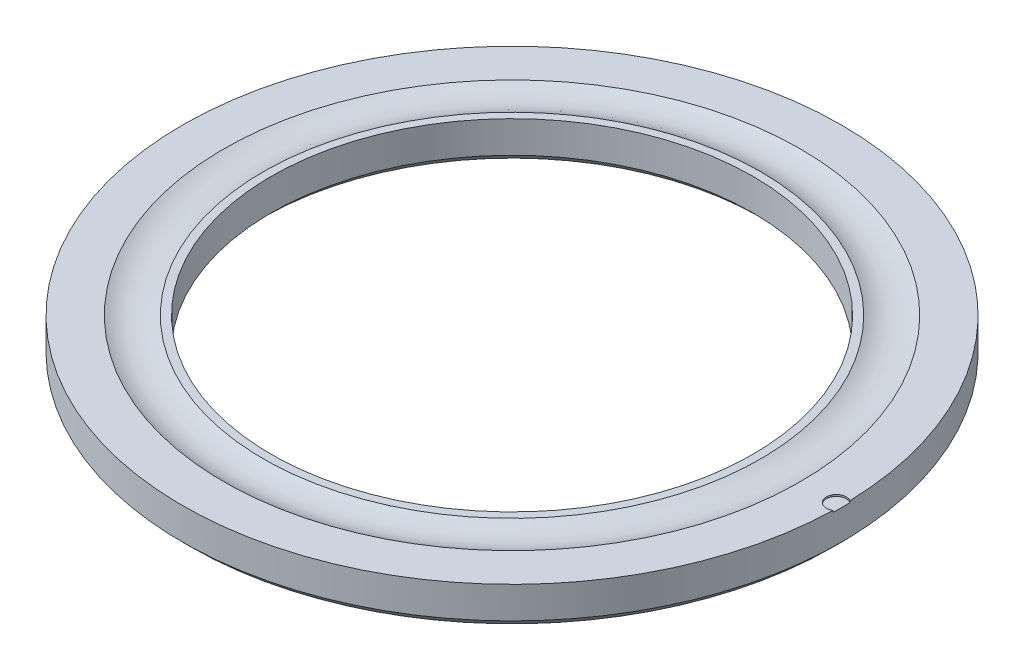
ISO-10303-21;
HEADER;
FILE_DESCRIPTION(('STEP AP214'),'2;1');
FILE_NAME('part.step','',(''),(''),'','','');
FILE_SCHEMA(('AUTOMOTIVE_DESIGN { 1 0 10303 214 1 1 1 1 }'));
ENDSEC;
DATA;
#1=APPLICATION_CONTEXT('core data for automotive mechanical design processes');
#2=APPLICATION_PROTOCOL_DEFINITION('international standard','automotive_design',2000,#1);
#3=PRODUCT_CONTEXT('',#1,'mechanical');
#4=PRODUCT('Part','Part','',(#3));
#5=PRODUCT_RELATED_PRODUCT_CATEGORY('part','',(#4));
#6=PRODUCT_DEFINITION_FORMATION('','',#4);
#7=PRODUCT_DEFINITION_CONTEXT('part definition',#1,'design');
#8=PRODUCT_DEFINITION('design','',#6,#7);
#9=PRODUCT_DEFINITION_SHAPE('','',#8);
#10=(LENGTH_UNIT() NAMED_UNIT(*) SI_UNIT(.MILLI.,.METRE.));
#11=(NAMED_UNIT(*) PLANE_ANGLE_UNIT() SI_UNIT($,.RADIAN.));
#12=(NAMED_UNIT(*) SI_UNIT($,.STERADIAN.) SOLID_ANGLE_UNIT());
#13=UNCERTAINTY_MEASURE_WITH_UNIT(LENGTH_MEASURE(1.E-05),#10,'distance_accuracy_value','');
#14=(GEOMETRIC_REPRESENTATION_CONTEXT(3) GLOBAL_UNCERTAINTY_ASSIGNED_CONTEXT((#13)) GLOBAL_UNIT_ASSIGNED_CONTEXT((#10,
#11,#12)) REPRESENTATION_CONTEXT('',''));
#15=CARTESIAN_POINT('',(0.,0.,0.));
#16=DIRECTION('',(0.,0.,1.));
#17=DIRECTION('',(1.,0.,0.));
#18=AXIS2_PLACEMENT_3D('',#15,#16,#17);
#19=CARTESIAN_POINT('',(0.,0.,0.));
#20=DIRECTION('',(0.,-1.,0.));
#21=DIRECTION('',(0.,0.,-1.));
#22=AXIS2_PLACEMENT_3D('',#19,#20,#21);
#23=CYLINDRICAL_SURFACE('',#22,28.5);
#24=CARTESIAN_POINT('',(0.,0.999999999999977,0.));
#25=DIRECTION('',(0.,-1.,0.));
#26=DIRECTION('',(0.,0.,-1.));
#27=AXIS2_PLACEMENT_3D('',#24,#25,#26);
#28=CIRCLE('',#27,28.5);
#29=CARTESIAN_POINT('',(0.,0.999999999999977,-28.5));
#30=VERTEX_POINT('',#29);
#31=EDGE_CURVE('E87',#30,#30,#28,.T.);
#32=ORIENTED_EDGE('',*,*,#31,.T.);
#33=EDGE_LOOP('',(#32));
#34=FACE_BOUND('',#33,.T.);
#35=CARTESIAN_POINT('',(0.,4.75,0.));
#36=DIRECTION('',(0.,-1.,0.));
#37=DIRECTION('',(0.,0.,-1.));
#38=AXIS2_PLACEMENT_3D('',#35,#36,#37);
#39=CIRCLE('',#38,28.5);
#40=CARTESIAN_POINT('',(0.,4.75,-28.5));
#41=VERTEX_POINT('',#40);
#42=EDGE_CURVE('E78',#41,#41,#39,.T.);
#43=ORIENTED_EDGE('',*,*,#42,.F.);
#44=EDGE_LOOP('',(#43));
#45=FACE_BOUND('',#44,.T.);
#46=ADVANCED_FACE('F43',(#34,#45),#23,.F.);
#47=CARTESIAN_POINT('',(28.5,0.,0.));
#48=DIRECTION('',(0.,-1.,0.));
#49=DIRECTION('',(0.,0.,-1.));
#50=AXIS2_PLACEMENT_3D('',#47,#48,#49);
#51=PLANE('',#50);
#52=CARTESIAN_POINT('',(0.,0.,0.));
#53=DIRECTION('',(0.,-1.,0.));
#54=DIRECTION('',(0.,0.,-1.));
#55=AXIS2_PLACEMENT_3D('',#52,#53,#54);
#56=CIRCLE('',#55,29.5);
#57=CARTESIAN_POINT('',(0.,0.,-29.5));
#58=VERTEX_POINT('',#57);
#59=EDGE_CURVE('E53',#58,#58,#56,.F.);
#60=ORIENTED_EDGE('',*,*,#59,.T.);
#61=EDGE_LOOP('',(#60));
#62=FACE_BOUND('',#61,.T.);
#63=CARTESIAN_POINT('',(0.,0.,0.));
#64=DIRECTION('',(0.,-1.,0.));
#65=DIRECTION('',(0.,0.,-1.));
#66=AXIS2_PLACEMENT_3D('',#63,#64,#65);
#67=CIRCLE('',#66,38.);
#68=CARTESIAN_POINT('',(0.,0.,-38.));
#69=VERTEX_POINT('',#68);
#70=EDGE_CURVE('E94',#69,#69,#67,.T.);
#71=ORIENTED_EDGE('',*,*,#70,.T.);
#72=EDGE_LOOP('',(#71));
#73=FACE_BOUND('',#72,.T.);
#74=ADVANCED_FACE('F105',(#62,#73),#51,.T.);
#75=CARTESIAN_POINT('',(0.,0.,0.));
#76=DIRECTION('',(0.,-1.,0.));
#77=DIRECTION('',(0.,0.,-1.));
#78=AXIS2_PLACEMENT_3D('',#75,#76,#77);
#79=CYLINDRICAL_SURFACE('',#78,39.);
#80=CARTESIAN_POINT('',(0.,0.999999999999994,0.));
#81=DIRECTION('',(0.,-1.,0.));
#82=DIRECTION('',(0.,0.,-1.));
#83=AXIS2_PLACEMENT_3D('',#80,#81,#82);
#84=CIRCLE('',#83,39.);
#85=CARTESIAN_POINT('',(0.,0.999999999999994,-39.));
#86=VERTEX_POINT('',#85);
#87=EDGE_CURVE('E11',#86,#86,#84,.F.);
#88=ORIENTED_EDGE('',*,*,#87,.T.);
#89=EDGE_LOOP('',(#88));
#90=FACE_BOUND('',#89,.T.);
#91=DIRECTION('',(0.,1.,0.));
#92=VECTOR('',#91,1.);
#93=CARTESIAN_POINT('',(38.9870026618739,4.65,1.00678867844529));
#94=LINE('',#93,#92);
#95=CARTESIAN_POINT('',(38.9870026618739,4.75,1.00678867844529));
#96=VERTEX_POINT('',#95);
#97=CARTESIAN_POINT('',(38.9870026618738,4.55,1.00678867844535));
#98=VERTEX_POINT('',#97);
#99=EDGE_CURVE('E70',#96,#98,#94,.F.);
#100=ORIENTED_EDGE('',*,*,#99,.F.);
#101=CARTESIAN_POINT('',(0.,4.75,0.));
#102=DIRECTION('',(0.,-1.,0.));
#103=DIRECTION('',(0.,0.,-1.));
#104=AXIS2_PLACEMENT_3D('',#101,#102,#103);
#105=CIRCLE('',#104,39.);
#106=CARTESIAN_POINT('',(38.9870026618738,4.75,-1.00678867844511));
#107=VERTEX_POINT('',#106);
#108=EDGE_CURVE('E97',#96,#107,#105,.T.);
#109=ORIENTED_EDGE('',*,*,#108,.T.);
#110=DIRECTION('',(0.,1.,0.));
#111=VECTOR('',#110,1.);
#112=CARTESIAN_POINT('',(38.9870026618739,4.65,-1.00678867844529));
#113=LINE('',#112,#111);
#114=CARTESIAN_POINT('',(38.9870026618738,4.55,-1.00678867844535));
#115=VERTEX_POINT('',#114);
#116=EDGE_CURVE('E60',#115,#107,#113,.T.);
#117=ORIENTED_EDGE('',*,*,#116,.F.);
#118=CARTESIAN_POINT('',(0.,4.55,0.));
#119=DIRECTION('',(0.,1.,0.));
#120=DIRECTION('',(0.,0.,1.));
#121=AXIS2_PLACEMENT_3D('',#118,#119,#120);
#122=CIRCLE('',#121,39.);
#123=EDGE_CURVE('E82',#115,#98,#122,.F.);
#124=ORIENTED_EDGE('',*,*,#123,.T.);
#125=EDGE_LOOP('',(#100,#109,#117,#124));
#126=FACE_BOUND('',#125,.T.);
#127=ADVANCED_FACE('F85',(#90,#126),#79,.T.);
#128=CARTESIAN_POINT('',(39.,4.75,0.));
#129=DIRECTION('',(0.,1.,0.));
#130=DIRECTION('',(0.,0.,1.));
#131=AXIS2_PLACEMENT_3D('',#128,#129,#130);
#132=PLANE('',#131);
#133=CARTESIAN_POINT('',(38.3817578484743,4.75,0.));
#134=DIRECTION('',(0.,1.,0.));
#135=DIRECTION('',(0.,0.,1.));
#136=AXIS2_PLACEMENT_3D('',#133,#134,#135);
#137=CIRCLE('',#136,1.17471048654243);
#138=EDGE_CURVE('E64',#107,#96,#137,.T.);
#139=ORIENTED_EDGE('',*,*,#138,.F.);
#140=ORIENTED_EDGE('',*,*,#108,.F.);
#141=EDGE_LOOP('',(#139,#140));
#142=FACE_BOUND('',#141,.T.);
#143=CARTESIAN_POINT('',(0.,4.75,0.));
#144=DIRECTION('',(0.,-1.,0.));
#145=DIRECTION('',(0.,0.,-1.));
#146=AXIS2_PLACEMENT_3D('',#143,#144,#145);
#147=CIRCLE('',#146,34.1178115349775);
#148=CARTESIAN_POINT('',(0.,4.75,-34.1178115349775));
#149=VERTEX_POINT('',#148);
#150=EDGE_CURVE('E122',#149,#149,#147,.T.);
#151=ORIENTED_EDGE('',*,*,#150,.T.);
#152=EDGE_LOOP('',(#151));
#153=FACE_BOUND('',#152,.T.);
#154=ADVANCED_FACE('F132',(#142,#153),#132,.T.);
#155=CARTESIAN_POINT('',(0.,9.17350243368668,0.));
#156=DIRECTION('',(0.,-1.,0.));
#157=DIRECTION('',(0.,0.,-1.));
#158=AXIS2_PLACEMENT_3D('',#155,#156,#157);
#159=TOROIDAL_SURFACE('',#158,31.7747790134954,5.0057142524873);
#160=CARTESIAN_POINT('',(0.,4.75,0.));
#161=DIRECTION('',(0.,-1.,0.));
#162=DIRECTION('',(0.,0.,-1.));
#163=AXIS2_PLACEMENT_3D('',#160,#161,#162);
#164=CIRCLE('',#163,29.4317464920134);
#165=CARTESIAN_POINT('',(0.,4.75,-29.4317464920134));
#166=VERTEX_POINT('',#165);
#167=EDGE_CURVE('E119',#166,#166,#164,.T.);
#168=ORIENTED_EDGE('',*,*,#167,.T.);
#169=EDGE_LOOP('',(#168));
#170=FACE_BOUND('',#169,.T.);
#171=ORIENTED_EDGE('',*,*,#150,.F.);
#172=EDGE_LOOP('',(#171));
#173=FACE_BOUND('',#172,.T.);
#174=ADVANCED_FACE('F134',(#170,#173),#159,.F.);
#175=CARTESIAN_POINT('',(29.4317464920134,4.75,0.));
#176=DIRECTION('',(0.,1.,0.));
#177=DIRECTION('',(0.,0.,1.));
#178=AXIS2_PLACEMENT_3D('',#175,#176,#177);
#179=PLANE('',#178);
#180=ORIENTED_EDGE('',*,*,#42,.T.);
#181=EDGE_LOOP('',(#180));
#182=FACE_BOUND('',#181,.T.);
#183=ORIENTED_EDGE('',*,*,#167,.F.);
#184=EDGE_LOOP('',(#183));
#185=FACE_BOUND('',#184,.T.);
#186=ADVANCED_FACE('F139',(#182,#185),#179,.T.);
#187=CARTESIAN_POINT('',(38.3817578484743,4.55,0.));
#188=DIRECTION('',(0.,1.,0.));
#189=DIRECTION('',(0.,0.,1.));
#190=AXIS2_PLACEMENT_3D('',#187,#188,#189);
#191=CYLINDRICAL_SURFACE('',#190,1.17471048654243);
#192=ORIENTED_EDGE('',*,*,#99,.T.);
#193=CARTESIAN_POINT('',(38.3817578484743,4.55,0.));
#194=DIRECTION('',(0.,1.,0.));
#195=DIRECTION('',(0.,0.,1.));
#196=AXIS2_PLACEMENT_3D('',#193,#194,#195);
#197=CIRCLE('',#196,1.17471048654243);
#198=EDGE_CURVE('E73',#115,#98,#197,.T.);
#199=ORIENTED_EDGE('',*,*,#198,.F.);
#200=ORIENTED_EDGE('',*,*,#116,.T.);
#201=ORIENTED_EDGE('',*,*,#138,.T.);
#202=EDGE_LOOP('',(#192,#199,#200,#201));
#203=FACE_BOUND('',#202,.T.);
#204=ADVANCED_FACE('F72',(#203),#191,.F.);
#205=CARTESIAN_POINT('',(38.3817578484743,4.55,0.));
#206=DIRECTION('',(0.,1.,0.));
#207=DIRECTION('',(0.,0.,1.));
#208=AXIS2_PLACEMENT_3D('',#205,#206,#207);
#209=PLANE('',#208);
#210=ORIENTED_EDGE('',*,*,#198,.T.);
#211=ORIENTED_EDGE('',*,*,#123,.F.);
#212=EDGE_LOOP('',(#210,#211));
#213=FACE_BOUND('',#212,.T.);
#214=ADVANCED_FACE('F81',(#213),#209,.T.);
#215=CARTESIAN_POINT('',(0.,0.999999999999977,0.));
#216=DIRECTION('',(0.,-1.,0.));
#217=DIRECTION('',(0.,0.,-1.));
#218=AXIS2_PLACEMENT_3D('',#215,#216,#217);
#219=CONICAL_SURFACE('',#218,28.5,0.785398163397453);
#220=ORIENTED_EDGE('',*,*,#59,.F.);
#221=EDGE_LOOP('',(#220));
#222=FACE_BOUND('',#221,.T.);
#223=ORIENTED_EDGE('',*,*,#31,.F.);
#224=EDGE_LOOP('',(#223));
#225=FACE_BOUND('',#224,.T.);
#226=ADVANCED_FACE('F108',(#222,#225),#219,.F.);
#227=CARTESIAN_POINT('',(0.,0.,0.));
#228=DIRECTION('',(0.,1.,0.));
#229=DIRECTION('',(0.,0.,1.));
#230=AXIS2_PLACEMENT_3D('',#227,#228,#229);
#231=CONICAL_SURFACE('',#230,38.,0.785398163397448);
#232=ORIENTED_EDGE('',*,*,#87,.F.);
#233=EDGE_LOOP('',(#232));
#234=FACE_BOUND('',#233,.T.);
#235=ORIENTED_EDGE('',*,*,#70,.F.);
#236=EDGE_LOOP('',(#235));
#237=FACE_BOUND('',#236,.T.);
#238=ADVANCED_FACE('F46',(#234,#237),#231,.T.);
#239=CLOSED_SHELL('',(#46,#74,#127,#154,#174,#186,#204,#214,#226,#238));
#240=MANIFOLD_SOLID_BREP('B2',#239);
#241=ADVANCED_BREP_SHAPE_REPRESENTATION('',(#18,#240),#14);
#242=SHAPE_DEFINITION_REPRESENTATION(#9,#241);
ENDSEC;
END-ISO-10303-21;
